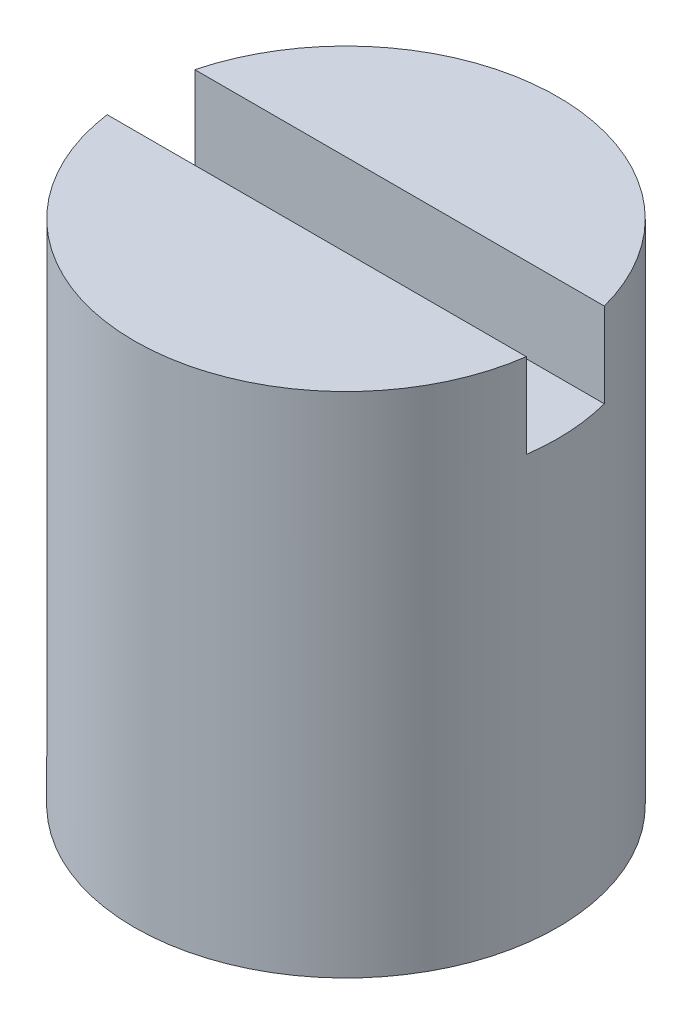
ISO-10303-21;
HEADER;
FILE_DESCRIPTION(('STEP AP214'),'2;1');
FILE_NAME('part.step','',(''),(''),'','','');
FILE_SCHEMA(('AUTOMOTIVE_DESIGN { 1 0 10303 214 1 1 1 1 }'));
ENDSEC;
DATA;
#1=APPLICATION_CONTEXT('core data for automotive mechanical design processes');
#2=APPLICATION_PROTOCOL_DEFINITION('international standard','automotive_design',2000,#1);
#3=PRODUCT_CONTEXT('',#1,'mechanical');
#4=PRODUCT('Part','Part','',(#3));
#5=PRODUCT_RELATED_PRODUCT_CATEGORY('part','',(#4));
#6=PRODUCT_DEFINITION_FORMATION('','',#4);
#7=PRODUCT_DEFINITION_CONTEXT('part definition',#1,'design');
#8=PRODUCT_DEFINITION('design','',#6,#7);
#9=PRODUCT_DEFINITION_SHAPE('','',#8);
#10=(LENGTH_UNIT() NAMED_UNIT(*) SI_UNIT(.MILLI.,.METRE.));
#11=(NAMED_UNIT(*) PLANE_ANGLE_UNIT() SI_UNIT($,.RADIAN.));
#12=(NAMED_UNIT(*) SI_UNIT($,.STERADIAN.) SOLID_ANGLE_UNIT());
#13=UNCERTAINTY_MEASURE_WITH_UNIT(LENGTH_MEASURE(1.E-05),#10,'distance_accuracy_value','');
#14=(GEOMETRIC_REPRESENTATION_CONTEXT(3) GLOBAL_UNCERTAINTY_ASSIGNED_CONTEXT((#13)) GLOBAL_UNIT_ASSIGNED_CONTEXT((#10,
#11,#12)) REPRESENTATION_CONTEXT('',''));
#15=CARTESIAN_POINT('',(0.,0.,0.));
#16=DIRECTION('',(0.,0.,1.));
#17=DIRECTION('',(1.,0.,0.));
#18=AXIS2_PLACEMENT_3D('',#15,#16,#17);
#19=CARTESIAN_POINT('',(0.,18.,0.));
#20=DIRECTION('',(0.,1.,0.));
#21=DIRECTION('',(0.,0.,1.));
#22=AXIS2_PLACEMENT_3D('',#19,#20,#21);
#23=PLANE('',#22);
#24=DIRECTION('',(-1.,0.,0.));
#25=VECTOR('',#24,1.);
#26=CARTESIAN_POINT('',(0.,18.,-1.89905648650498));
#27=LINE('',#26,#25);
#28=CARTESIAN_POINT('',(7.25558987685105,18.,-1.89905648650498));
#29=VERTEX_POINT('',#28);
#30=CARTESIAN_POINT('',(-7.25558987685105,18.,-1.89905648650498));
#31=VERTEX_POINT('',#30);
#32=EDGE_CURVE('E90',#29,#31,#27,.T.);
#33=ORIENTED_EDGE('',*,*,#32,.F.);
#34=CARTESIAN_POINT('',(0.,18.,0.));
#35=DIRECTION('',(0.,1.,0.));
#36=DIRECTION('',(0.,0.,1.));
#37=AXIS2_PLACEMENT_3D('',#34,#35,#36);
#38=CIRCLE('',#37,7.5);
#39=EDGE_CURVE('E91',#29,#31,#38,.T.);
#40=ORIENTED_EDGE('',*,*,#39,.T.);
#41=EDGE_LOOP('',(#33,#40));
#42=FACE_BOUND('',#41,.T.);
#43=ADVANCED_FACE('F43',(#42),#23,.T.);
#44=CARTESIAN_POINT('',(0.,18.,0.));
#45=DIRECTION('',(0.,-1.,0.));
#46=DIRECTION('',(0.,0.,-1.));
#47=AXIS2_PLACEMENT_3D('',#44,#45,#46);
#48=CYLINDRICAL_SURFACE('',#47,7.5);
#49=ORIENTED_EDGE('',*,*,#39,.F.);
#50=DIRECTION('',(0.,-1.,0.));
#51=VECTOR('',#50,1.);
#52=CARTESIAN_POINT('',(7.25558987685104,18.,-1.89905648650498));
#53=LINE('',#52,#51);
#54=CARTESIAN_POINT('',(7.25558987685105,15.,-1.89905648650498));
#55=VERTEX_POINT('',#54);
#56=EDGE_CURVE('E106',#29,#55,#53,.T.);
#57=ORIENTED_EDGE('',*,*,#56,.T.);
#58=CARTESIAN_POINT('',(0.,15.,0.));
#59=DIRECTION('',(0.,1.,0.));
#60=DIRECTION('',(0.,0.,1.));
#61=AXIS2_PLACEMENT_3D('',#58,#59,#60);
#62=CIRCLE('',#61,7.5);
#63=CARTESIAN_POINT('',(7.42799318057338,15.,1.03678218992964));
#64=VERTEX_POINT('',#63);
#65=EDGE_CURVE('E11',#64,#55,#62,.T.);
#66=ORIENTED_EDGE('',*,*,#65,.F.);
#67=DIRECTION('',(0.,-1.,0.));
#68=VECTOR('',#67,1.);
#69=CARTESIAN_POINT('',(7.42799318057338,18.,1.03678218992964));
#70=LINE('',#69,#68);
#71=CARTESIAN_POINT('',(7.42799318057338,18.,1.03678218992964));
#72=VERTEX_POINT('',#71);
#73=EDGE_CURVE('E85',#64,#72,#70,.F.);
#74=ORIENTED_EDGE('',*,*,#73,.T.);
#75=CARTESIAN_POINT('',(-7.42799318057338,18.,1.03678218992964));
#76=VERTEX_POINT('',#75);
#77=EDGE_CURVE('E97',#76,#72,#38,.T.);
#78=ORIENTED_EDGE('',*,*,#77,.F.);
#79=DIRECTION('',(0.,-1.,0.));
#80=VECTOR('',#79,1.);
#81=CARTESIAN_POINT('',(-7.42799318057338,18.,1.03678218992964));
#82=LINE('',#81,#80);
#83=CARTESIAN_POINT('',(-7.42799318057338,15.,1.03678218992964));
#84=VERTEX_POINT('',#83);
#85=EDGE_CURVE('E58',#76,#84,#82,.T.);
#86=ORIENTED_EDGE('',*,*,#85,.T.);
#87=CARTESIAN_POINT('',(-7.25558987685105,15.,-1.89905648650498));
#88=VERTEX_POINT('',#87);
#89=EDGE_CURVE('E47',#88,#84,#62,.T.);
#90=ORIENTED_EDGE('',*,*,#89,.F.);
#91=DIRECTION('',(0.,-1.,0.));
#92=VECTOR('',#91,1.);
#93=CARTESIAN_POINT('',(-7.25558987685104,18.,-1.89905648650498));
#94=LINE('',#93,#92);
#95=EDGE_CURVE('E66',#88,#31,#94,.F.);
#96=ORIENTED_EDGE('',*,*,#95,.T.);
#97=EDGE_LOOP('',(#49,#57,#66,#74,#78,#86,#90,#96));
#98=FACE_BOUND('',#97,.T.);
#99=CARTESIAN_POINT('',(0.,0.,0.));
#100=DIRECTION('',(0.,1.,0.));
#101=DIRECTION('',(0.,0.,1.));
#102=AXIS2_PLACEMENT_3D('',#99,#100,#101);
#103=CIRCLE('',#102,7.5);
#104=CARTESIAN_POINT('',(0.,0.,7.5));
#105=VERTEX_POINT('',#104);
#106=EDGE_CURVE('E102',#105,#105,#103,.T.);
#107=ORIENTED_EDGE('',*,*,#106,.T.);
#108=EDGE_LOOP('',(#107));
#109=FACE_BOUND('',#108,.T.);
#110=ADVANCED_FACE('F45',(#98,#109),#48,.T.);
#111=DIRECTION('',(1.,0.,0.));
#112=VECTOR('',#111,1.);
#113=CARTESIAN_POINT('',(0.,18.,1.03678218992964));
#114=LINE('',#113,#112);
#115=EDGE_CURVE('E82',#76,#72,#114,.T.);
#116=ORIENTED_EDGE('',*,*,#115,.F.);
#117=ORIENTED_EDGE('',*,*,#77,.T.);
#118=EDGE_LOOP('',(#116,#117));
#119=FACE_BOUND('',#118,.T.);
#120=ADVANCED_FACE('F101',(#119),#23,.T.);
#121=CARTESIAN_POINT('',(0.,0.,0.));
#122=DIRECTION('',(0.,1.,0.));
#123=DIRECTION('',(0.,0.,1.));
#124=AXIS2_PLACEMENT_3D('',#121,#122,#123);
#125=PLANE('',#124);
#126=ORIENTED_EDGE('',*,*,#106,.F.);
#127=EDGE_LOOP('',(#126));
#128=FACE_BOUND('',#127,.T.);
#129=ADVANCED_FACE('F128',(#128),#125,.F.);
#130=CARTESIAN_POINT('',(0.,15.,0.));
#131=DIRECTION('',(0.,1.,0.));
#132=DIRECTION('',(0.,0.,1.));
#133=AXIS2_PLACEMENT_3D('',#130,#131,#132);
#134=PLANE('',#133);
#135=ORIENTED_EDGE('',*,*,#65,.T.);
#136=DIRECTION('',(-1.,0.,0.));
#137=VECTOR('',#136,1.);
#138=CARTESIAN_POINT('',(-12.681065569063,15.,-1.89905648650498));
#139=LINE('',#138,#137);
#140=EDGE_CURVE('E99',#55,#88,#139,.T.);
#141=ORIENTED_EDGE('',*,*,#140,.T.);
#142=ORIENTED_EDGE('',*,*,#89,.T.);
#143=DIRECTION('',(1.,0.,0.));
#144=VECTOR('',#143,1.);
#145=CARTESIAN_POINT('',(-12.681065569063,15.,1.03678218992964));
#146=LINE('',#145,#144);
#147=EDGE_CURVE('E114',#84,#64,#146,.T.);
#148=ORIENTED_EDGE('',*,*,#147,.T.);
#149=EDGE_LOOP('',(#135,#141,#142,#148));
#150=FACE_BOUND('',#149,.T.);
#151=ADVANCED_FACE('F113',(#150),#134,.T.);
#152=CARTESIAN_POINT('',(-12.681065569063,15.,-1.89905648650498));
#153=DIRECTION('',(0.,0.,-1.));
#154=DIRECTION('',(-1.,0.,0.));
#155=AXIS2_PLACEMENT_3D('',#152,#153,#154);
#156=PLANE('',#155);
#157=ORIENTED_EDGE('',*,*,#32,.T.);
#158=ORIENTED_EDGE('',*,*,#95,.F.);
#159=ORIENTED_EDGE('',*,*,#140,.F.);
#160=ORIENTED_EDGE('',*,*,#56,.F.);
#161=EDGE_LOOP('',(#157,#158,#159,#160));
#162=FACE_BOUND('',#161,.T.);
#163=ADVANCED_FACE('F118',(#162),#156,.F.);
#164=CARTESIAN_POINT('',(-12.681065569063,15.,1.03678218992964));
#165=DIRECTION('',(0.,0.,1.));
#166=DIRECTION('',(1.,0.,0.));
#167=AXIS2_PLACEMENT_3D('',#164,#165,#166);
#168=PLANE('',#167);
#169=ORIENTED_EDGE('',*,*,#115,.T.);
#170=ORIENTED_EDGE('',*,*,#73,.F.);
#171=ORIENTED_EDGE('',*,*,#147,.F.);
#172=ORIENTED_EDGE('',*,*,#85,.F.);
#173=EDGE_LOOP('',(#169,#170,#171,#172));
#174=FACE_BOUND('',#173,.T.);
#175=ADVANCED_FACE('F84',(#174),#168,.F.);
#176=CLOSED_SHELL('',(#43,#110,#120,#129,#151,#163,#175));
#177=MANIFOLD_SOLID_BREP('B2',#176);
#178=ADVANCED_BREP_SHAPE_REPRESENTATION('',(#18,#177),#14);
#179=SHAPE_DEFINITION_REPRESENTATION(#9,#178);
ENDSEC;
END-ISO-10303-21;
